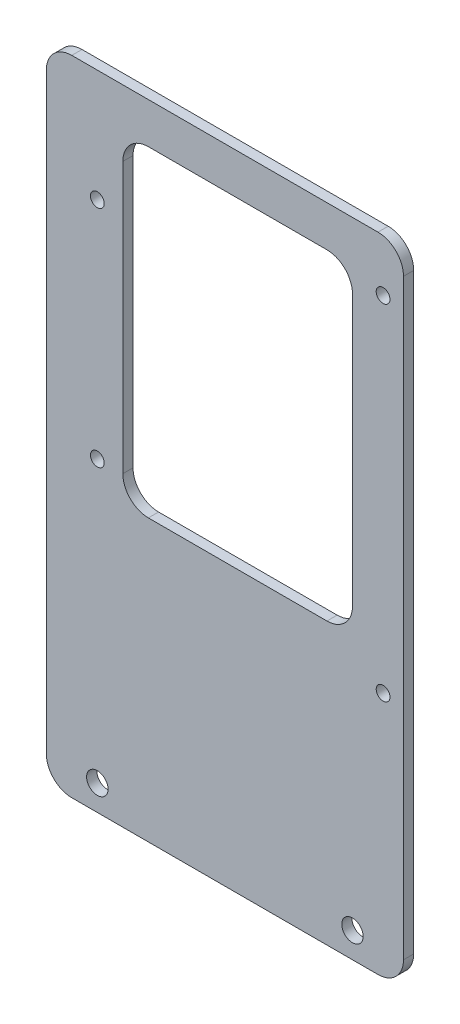
ISO-10303-21;
HEADER;
FILE_DESCRIPTION(('STEP AP214'),'2;1');
FILE_NAME('part.step','',(''),(''),'','','');
FILE_SCHEMA(('AUTOMOTIVE_DESIGN { 1 0 10303 214 1 1 1 1 }'));
ENDSEC;
DATA;
#1=APPLICATION_CONTEXT('core data for automotive mechanical design processes');
#2=APPLICATION_PROTOCOL_DEFINITION('international standard','automotive_design',2000,#1);
#3=PRODUCT_CONTEXT('',#1,'mechanical');
#4=PRODUCT('Part','Part','',(#3));
#5=PRODUCT_RELATED_PRODUCT_CATEGORY('part','',(#4));
#6=PRODUCT_DEFINITION_FORMATION('','',#4);
#7=PRODUCT_DEFINITION_CONTEXT('part definition',#1,'design');
#8=PRODUCT_DEFINITION('design','',#6,#7);
#9=PRODUCT_DEFINITION_SHAPE('','',#8);
#10=(LENGTH_UNIT() NAMED_UNIT(*) SI_UNIT(.MILLI.,.METRE.));
#11=(NAMED_UNIT(*) PLANE_ANGLE_UNIT() SI_UNIT($,.RADIAN.));
#12=(NAMED_UNIT(*) SI_UNIT($,.STERADIAN.) SOLID_ANGLE_UNIT());
#13=UNCERTAINTY_MEASURE_WITH_UNIT(LENGTH_MEASURE(1.E-05),#10,'distance_accuracy_value','');
#14=(GEOMETRIC_REPRESENTATION_CONTEXT(3) GLOBAL_UNCERTAINTY_ASSIGNED_CONTEXT((#13)) GLOBAL_UNIT_ASSIGNED_CONTEXT((#10,
#11,#12)) REPRESENTATION_CONTEXT('',''));
#15=CARTESIAN_POINT('',(0.,0.,0.));
#16=DIRECTION('',(0.,0.,1.));
#17=DIRECTION('',(1.,0.,0.));
#18=AXIS2_PLACEMENT_3D('',#15,#16,#17);
#19=CARTESIAN_POINT('',(35.,-63.,2.));
#20=DIRECTION('',(-1.,0.,0.));
#21=DIRECTION('',(0.,0.,1.));
#22=AXIS2_PLACEMENT_3D('',#19,#20,#21);
#23=PLANE('',#22);
#24=DIRECTION('',(0.,1.,0.));
#25=VECTOR('',#24,1.);
#26=CARTESIAN_POINT('',(35.,-63.,2.));
#27=LINE('',#26,#25);
#28=CARTESIAN_POINT('',(35.,-58.,2.));
#29=VERTEX_POINT('',#28);
#30=CARTESIAN_POINT('',(35.,58.,2.));
#31=VERTEX_POINT('',#30);
#32=EDGE_CURVE('E167',#29,#31,#27,.T.);
#33=ORIENTED_EDGE('',*,*,#32,.F.);
#34=DIRECTION('',(0.,0.,-1.));
#35=VECTOR('',#34,1.);
#36=CARTESIAN_POINT('',(35.,-58.,2.));
#37=LINE('',#36,#35);
#38=CARTESIAN_POINT('',(35.,-58.,0.));
#39=VERTEX_POINT('',#38);
#40=EDGE_CURVE('E152',#29,#39,#37,.T.);
#41=ORIENTED_EDGE('',*,*,#40,.T.);
#42=DIRECTION('',(0.,1.,0.));
#43=VECTOR('',#42,1.);
#44=CARTESIAN_POINT('',(35.,-63.,0.));
#45=LINE('',#44,#43);
#46=CARTESIAN_POINT('',(35.,58.,0.));
#47=VERTEX_POINT('',#46);
#48=EDGE_CURVE('E164',#39,#47,#45,.T.);
#49=ORIENTED_EDGE('',*,*,#48,.T.);
#50=DIRECTION('',(0.,0.,-1.));
#51=VECTOR('',#50,1.);
#52=CARTESIAN_POINT('',(35.,58.,2.));
#53=LINE('',#52,#51);
#54=EDGE_CURVE('E169',#47,#31,#53,.F.);
#55=ORIENTED_EDGE('',*,*,#54,.T.);
#56=EDGE_LOOP('',(#33,#41,#49,#55));
#57=FACE_BOUND('',#56,.T.);
#58=ADVANCED_FACE('F34',(#57),#23,.F.);
#59=CARTESIAN_POINT('',(-35.,63.,2.));
#60=DIRECTION('',(0.,-1.,0.));
#61=DIRECTION('',(0.,0.,-1.));
#62=AXIS2_PLACEMENT_3D('',#59,#60,#61);
#63=PLANE('',#62);
#64=DIRECTION('',(-1.,0.,0.));
#65=VECTOR('',#64,1.);
#66=CARTESIAN_POINT('',(-35.,63.,2.));
#67=LINE('',#66,#65);
#68=CARTESIAN_POINT('',(30.,63.,2.));
#69=VERTEX_POINT('',#68);
#70=CARTESIAN_POINT('',(-30.,63.,2.));
#71=VERTEX_POINT('',#70);
#72=EDGE_CURVE('E347',#69,#71,#67,.T.);
#73=ORIENTED_EDGE('',*,*,#72,.F.);
#74=DIRECTION('',(0.,0.,-1.));
#75=VECTOR('',#74,1.);
#76=CARTESIAN_POINT('',(30.,63.,2.));
#77=LINE('',#76,#75);
#78=CARTESIAN_POINT('',(30.,63.,0.));
#79=VERTEX_POINT('',#78);
#80=EDGE_CURVE('E213',#69,#79,#77,.T.);
#81=ORIENTED_EDGE('',*,*,#80,.T.);
#82=DIRECTION('',(-1.,0.,0.));
#83=VECTOR('',#82,1.);
#84=CARTESIAN_POINT('',(-35.,63.,0.));
#85=LINE('',#84,#83);
#86=CARTESIAN_POINT('',(-30.,63.,0.));
#87=VERTEX_POINT('',#86);
#88=EDGE_CURVE('E174',#79,#87,#85,.T.);
#89=ORIENTED_EDGE('',*,*,#88,.T.);
#90=DIRECTION('',(0.,0.,-1.));
#91=VECTOR('',#90,1.);
#92=CARTESIAN_POINT('',(-30.,63.,2.));
#93=LINE('',#92,#91);
#94=EDGE_CURVE('E211',#87,#71,#93,.F.);
#95=ORIENTED_EDGE('',*,*,#94,.T.);
#96=EDGE_LOOP('',(#73,#81,#89,#95));
#97=FACE_BOUND('',#96,.T.);
#98=ADVANCED_FACE('F306',(#97),#63,.F.);
#99=CARTESIAN_POINT('',(-35.,-63.,2.));
#100=DIRECTION('',(1.,0.,0.));
#101=DIRECTION('',(0.,0.,-1.));
#102=AXIS2_PLACEMENT_3D('',#99,#100,#101);
#103=PLANE('',#102);
#104=DIRECTION('',(0.,-1.,0.));
#105=VECTOR('',#104,1.);
#106=CARTESIAN_POINT('',(-35.,-63.,0.));
#107=LINE('',#106,#105);
#108=CARTESIAN_POINT('',(-35.,58.,0.));
#109=VERTEX_POINT('',#108);
#110=CARTESIAN_POINT('',(-35.,-58.,0.));
#111=VERTEX_POINT('',#110);
#112=EDGE_CURVE('E178',#109,#111,#107,.T.);
#113=ORIENTED_EDGE('',*,*,#112,.T.);
#114=DIRECTION('',(0.,0.,-1.));
#115=VECTOR('',#114,1.);
#116=CARTESIAN_POINT('',(-35.,-58.,2.));
#117=LINE('',#116,#115);
#118=CARTESIAN_POINT('',(-35.,-58.,2.));
#119=VERTEX_POINT('',#118);
#120=EDGE_CURVE('E209',#111,#119,#117,.F.);
#121=ORIENTED_EDGE('',*,*,#120,.T.);
#122=DIRECTION('',(0.,-1.,0.));
#123=VECTOR('',#122,1.);
#124=CARTESIAN_POINT('',(-35.,-63.,2.));
#125=LINE('',#124,#123);
#126=CARTESIAN_POINT('',(-35.,58.,2.));
#127=VERTEX_POINT('',#126);
#128=EDGE_CURVE('E344',#127,#119,#125,.T.);
#129=ORIENTED_EDGE('',*,*,#128,.F.);
#130=DIRECTION('',(0.,0.,-1.));
#131=VECTOR('',#130,1.);
#132=CARTESIAN_POINT('',(-35.,58.,2.));
#133=LINE('',#132,#131);
#134=EDGE_CURVE('E206',#127,#109,#133,.T.);
#135=ORIENTED_EDGE('',*,*,#134,.T.);
#136=EDGE_LOOP('',(#113,#121,#129,#135));
#137=FACE_BOUND('',#136,.T.);
#138=ADVANCED_FACE('F311',(#137),#103,.F.);
#139=CARTESIAN_POINT('',(-35.,-63.,2.));
#140=DIRECTION('',(0.,1.,0.));
#141=DIRECTION('',(0.,0.,1.));
#142=AXIS2_PLACEMENT_3D('',#139,#140,#141);
#143=PLANE('',#142);
#144=DIRECTION('',(1.,0.,0.));
#145=VECTOR('',#144,1.);
#146=CARTESIAN_POINT('',(-35.,-63.,0.));
#147=LINE('',#146,#145);
#148=CARTESIAN_POINT('',(-30.,-63.,0.));
#149=VERTEX_POINT('',#148);
#150=CARTESIAN_POINT('',(30.,-63.,0.));
#151=VERTEX_POINT('',#150);
#152=EDGE_CURVE('E189',#149,#151,#147,.T.);
#153=ORIENTED_EDGE('',*,*,#152,.T.);
#154=DIRECTION('',(0.,0.,-1.));
#155=VECTOR('',#154,1.);
#156=CARTESIAN_POINT('',(30.,-63.,2.));
#157=LINE('',#156,#155);
#158=CARTESIAN_POINT('',(30.,-63.,2.));
#159=VERTEX_POINT('',#158);
#160=EDGE_CURVE('E153',#151,#159,#157,.F.);
#161=ORIENTED_EDGE('',*,*,#160,.T.);
#162=DIRECTION('',(1.,0.,0.));
#163=VECTOR('',#162,1.);
#164=CARTESIAN_POINT('',(-35.,-63.,2.));
#165=LINE('',#164,#163);
#166=CARTESIAN_POINT('',(-30.,-63.,2.));
#167=VERTEX_POINT('',#166);
#168=EDGE_CURVE('E184',#167,#159,#165,.T.);
#169=ORIENTED_EDGE('',*,*,#168,.F.);
#170=DIRECTION('',(0.,0.,-1.));
#171=VECTOR('',#170,1.);
#172=CARTESIAN_POINT('',(-30.,-63.,2.));
#173=LINE('',#172,#171);
#174=EDGE_CURVE('E158',#167,#149,#173,.T.);
#175=ORIENTED_EDGE('',*,*,#174,.T.);
#176=EDGE_LOOP('',(#153,#161,#169,#175));
#177=FACE_BOUND('',#176,.T.);
#178=ADVANCED_FACE('F401',(#177),#143,.F.);
#179=CARTESIAN_POINT('',(0.,0.,2.));
#180=DIRECTION('',(0.,0.,-1.));
#181=DIRECTION('',(-1.,0.,0.));
#182=AXIS2_PLACEMENT_3D('',#179,#180,#181);
#183=PLANE('',#182);
#184=DIRECTION('',(-1.,0.,0.));
#185=VECTOR('',#184,1.);
#186=CARTESIAN_POINT('',(-20.,55.,2.));
#187=LINE('',#186,#185);
#188=CARTESIAN_POINT('',(20.,55.,2.));
#189=VERTEX_POINT('',#188);
#190=CARTESIAN_POINT('',(-15.,55.,2.));
#191=VERTEX_POINT('',#190);
#192=EDGE_CURVE('E270',#189,#191,#187,.T.);
#193=ORIENTED_EDGE('',*,*,#192,.F.);
#194=CARTESIAN_POINT('',(20.,50.,2.));
#195=DIRECTION('',(0.,0.,-1.));
#196=DIRECTION('',(-1.,0.,0.));
#197=AXIS2_PLACEMENT_3D('',#194,#195,#196);
#198=CIRCLE('',#197,5.);
#199=CARTESIAN_POINT('',(25.,50.,2.));
#200=VERTEX_POINT('',#199);
#201=EDGE_CURVE('E57',#189,#200,#198,.T.);
#202=ORIENTED_EDGE('',*,*,#201,.T.);
#203=DIRECTION('',(0.,1.,0.));
#204=VECTOR('',#203,1.);
#205=CARTESIAN_POINT('',(25.,-8.,2.));
#206=LINE('',#205,#204);
#207=CARTESIAN_POINT('',(25.,-3.,2.));
#208=VERTEX_POINT('',#207);
#209=EDGE_CURVE('E289',#208,#200,#206,.T.);
#210=ORIENTED_EDGE('',*,*,#209,.F.);
#211=CARTESIAN_POINT('',(20.,-3.,2.));
#212=DIRECTION('',(0.,0.,-1.));
#213=DIRECTION('',(-1.,0.,0.));
#214=AXIS2_PLACEMENT_3D('',#211,#212,#213);
#215=CIRCLE('',#214,5.);
#216=CARTESIAN_POINT('',(20.,-8.,2.));
#217=VERTEX_POINT('',#216);
#218=EDGE_CURVE('E247',#208,#217,#215,.T.);
#219=ORIENTED_EDGE('',*,*,#218,.T.);
#220=DIRECTION('',(1.,0.,0.));
#221=VECTOR('',#220,1.);
#222=CARTESIAN_POINT('',(-20.,-8.,2.));
#223=LINE('',#222,#221);
#224=CARTESIAN_POINT('',(-15.,-8.,2.));
#225=VERTEX_POINT('',#224);
#226=EDGE_CURVE('E262',#225,#217,#223,.T.);
#227=ORIENTED_EDGE('',*,*,#226,.F.);
#228=CARTESIAN_POINT('',(-15.,-3.,2.));
#229=DIRECTION('',(0.,0.,-1.));
#230=DIRECTION('',(-1.,0.,0.));
#231=AXIS2_PLACEMENT_3D('',#228,#229,#230);
#232=CIRCLE('',#231,5.);
#233=CARTESIAN_POINT('',(-20.,-3.,2.));
#234=VERTEX_POINT('',#233);
#235=EDGE_CURVE('E42',#225,#234,#232,.T.);
#236=ORIENTED_EDGE('',*,*,#235,.T.);
#237=DIRECTION('',(0.,-1.,0.));
#238=VECTOR('',#237,1.);
#239=CARTESIAN_POINT('',(-20.,-8.,2.));
#240=LINE('',#239,#238);
#241=CARTESIAN_POINT('',(-20.,50.,2.));
#242=VERTEX_POINT('',#241);
#243=EDGE_CURVE('E260',#242,#234,#240,.T.);
#244=ORIENTED_EDGE('',*,*,#243,.F.);
#245=CARTESIAN_POINT('',(-15.,50.,2.));
#246=DIRECTION('',(0.,0.,-1.));
#247=DIRECTION('',(-1.,0.,0.));
#248=AXIS2_PLACEMENT_3D('',#245,#246,#247);
#249=CIRCLE('',#248,5.);
#250=EDGE_CURVE('E49',#242,#191,#249,.T.);
#251=ORIENTED_EDGE('',*,*,#250,.T.);
#252=EDGE_LOOP('',(#193,#202,#210,#219,#227,#236,#244,#251));
#253=FACE_BOUND('',#252,.T.);
#254=CARTESIAN_POINT('',(31.,52.75,2.));
#255=DIRECTION('',(0.,0.,1.));
#256=DIRECTION('',(1.,0.,0.));
#257=AXIS2_PLACEMENT_3D('',#254,#255,#256);
#258=CIRCLE('',#257,1.35000000000001);
#259=CARTESIAN_POINT('',(32.35,52.75,2.));
#260=VERTEX_POINT('',#259);
#261=EDGE_CURVE('E357',#260,#260,#258,.T.);
#262=ORIENTED_EDGE('',*,*,#261,.F.);
#263=EDGE_LOOP('',(#262));
#264=FACE_BOUND('',#263,.T.);
#265=CARTESIAN_POINT('',(25.,-58.,2.));
#266=DIRECTION('',(0.,0.,1.));
#267=DIRECTION('',(-1.,0.,0.));
#268=AXIS2_PLACEMENT_3D('',#265,#266,#267);
#269=CIRCLE('',#268,2.1);
#270=CARTESIAN_POINT('',(22.9,-58.,2.));
#271=VERTEX_POINT('',#270);
#272=EDGE_CURVE('E371',#271,#271,#269,.T.);
#273=ORIENTED_EDGE('',*,*,#272,.F.);
#274=EDGE_LOOP('',(#273));
#275=FACE_BOUND('',#274,.T.);
#276=CARTESIAN_POINT('',(-25.,-3.,2.));
#277=DIRECTION('',(0.,0.,1.));
#278=DIRECTION('',(1.,0.,0.));
#279=AXIS2_PLACEMENT_3D('',#276,#277,#278);
#280=CIRCLE('',#279,1.35);
#281=CARTESIAN_POINT('',(-23.65,-3.,2.));
#282=VERTEX_POINT('',#281);
#283=EDGE_CURVE('E364',#282,#282,#280,.T.);
#284=ORIENTED_EDGE('',*,*,#283,.F.);
#285=EDGE_LOOP('',(#284));
#286=FACE_BOUND('',#285,.T.);
#287=CARTESIAN_POINT('',(-25.,41.,2.));
#288=DIRECTION('',(0.,0.,1.));
#289=DIRECTION('',(1.,0.,0.));
#290=AXIS2_PLACEMENT_3D('',#287,#288,#289);
#291=CIRCLE('',#290,1.35);
#292=CARTESIAN_POINT('',(-23.65,41.,2.));
#293=VERTEX_POINT('',#292);
#294=EDGE_CURVE('E381',#293,#293,#291,.T.);
#295=ORIENTED_EDGE('',*,*,#294,.F.);
#296=EDGE_LOOP('',(#295));
#297=FACE_BOUND('',#296,.T.);
#298=CARTESIAN_POINT('',(31.,-14.75,2.));
#299=DIRECTION('',(0.,0.,1.));
#300=DIRECTION('',(1.,0.,0.));
#301=AXIS2_PLACEMENT_3D('',#298,#299,#300);
#302=CIRCLE('',#301,1.35);
#303=CARTESIAN_POINT('',(32.35,-14.75,2.));
#304=VERTEX_POINT('',#303);
#305=EDGE_CURVE('E363',#304,#304,#302,.T.);
#306=ORIENTED_EDGE('',*,*,#305,.F.);
#307=EDGE_LOOP('',(#306));
#308=FACE_BOUND('',#307,.T.);
#309=CARTESIAN_POINT('',(-25.,-58.,2.));
#310=DIRECTION('',(0.,0.,1.));
#311=DIRECTION('',(1.,0.,0.));
#312=AXIS2_PLACEMENT_3D('',#309,#310,#311);
#313=CIRCLE('',#312,2.1);
#314=CARTESIAN_POINT('',(-22.9,-58.,2.));
#315=VERTEX_POINT('',#314);
#316=EDGE_CURVE('E181',#315,#315,#313,.T.);
#317=ORIENTED_EDGE('',*,*,#316,.F.);
#318=EDGE_LOOP('',(#317));
#319=FACE_BOUND('',#318,.T.);
#320=ORIENTED_EDGE('',*,*,#168,.T.);
#321=CARTESIAN_POINT('',(30.,-58.,2.));
#322=DIRECTION('',(0.,0.,-1.));
#323=DIRECTION('',(-1.,0.,0.));
#324=AXIS2_PLACEMENT_3D('',#321,#322,#323);
#325=CIRCLE('',#324,5.);
#326=EDGE_CURVE('E204',#159,#29,#325,.F.);
#327=ORIENTED_EDGE('',*,*,#326,.T.);
#328=ORIENTED_EDGE('',*,*,#32,.T.);
#329=CARTESIAN_POINT('',(30.,58.,2.));
#330=DIRECTION('',(0.,0.,-1.));
#331=DIRECTION('',(-1.,0.,0.));
#332=AXIS2_PLACEMENT_3D('',#329,#330,#331);
#333=CIRCLE('',#332,5.);
#334=EDGE_CURVE('E200',#31,#69,#333,.F.);
#335=ORIENTED_EDGE('',*,*,#334,.T.);
#336=ORIENTED_EDGE('',*,*,#72,.T.);
#337=CARTESIAN_POINT('',(-30.,58.,2.));
#338=DIRECTION('',(0.,0.,-1.));
#339=DIRECTION('',(-1.,0.,0.));
#340=AXIS2_PLACEMENT_3D('',#337,#338,#339);
#341=CIRCLE('',#340,5.);
#342=EDGE_CURVE('E198',#71,#127,#341,.F.);
#343=ORIENTED_EDGE('',*,*,#342,.T.);
#344=ORIENTED_EDGE('',*,*,#128,.T.);
#345=CARTESIAN_POINT('',(-30.,-58.,2.));
#346=DIRECTION('',(0.,0.,-1.));
#347=DIRECTION('',(-1.,0.,0.));
#348=AXIS2_PLACEMENT_3D('',#345,#346,#347);
#349=CIRCLE('',#348,5.);
#350=EDGE_CURVE('E202',#119,#167,#349,.F.);
#351=ORIENTED_EDGE('',*,*,#350,.T.);
#352=EDGE_LOOP('',(#320,#327,#328,#335,#336,#343,#344,#351));
#353=FACE_BOUND('',#352,.T.);
#354=ADVANCED_FACE('F258',(#253,#264,#275,#286,#297,#308,#319,#353),#183,.F.);
#355=CARTESIAN_POINT('',(0.,0.,0.));
#356=DIRECTION('',(0.,0.,-1.));
#357=DIRECTION('',(-1.,0.,0.));
#358=AXIS2_PLACEMENT_3D('',#355,#356,#357);
#359=PLANE('',#358);
#360=DIRECTION('',(0.,-1.,0.));
#361=VECTOR('',#360,1.);
#362=CARTESIAN_POINT('',(25.,0.,0.));
#363=LINE('',#362,#361);
#364=CARTESIAN_POINT('',(25.,50.,0.));
#365=VERTEX_POINT('',#364);
#366=CARTESIAN_POINT('',(25.,-3.,0.));
#367=VERTEX_POINT('',#366);
#368=EDGE_CURVE('E225',#365,#367,#363,.T.);
#369=ORIENTED_EDGE('',*,*,#368,.F.);
#370=CARTESIAN_POINT('',(20.,50.,0.));
#371=DIRECTION('',(0.,0.,-1.));
#372=DIRECTION('',(-1.,0.,0.));
#373=AXIS2_PLACEMENT_3D('',#370,#371,#372);
#374=CIRCLE('',#373,5.);
#375=CARTESIAN_POINT('',(20.,55.,0.));
#376=VERTEX_POINT('',#375);
#377=EDGE_CURVE('E255',#365,#376,#374,.F.);
#378=ORIENTED_EDGE('',*,*,#377,.T.);
#379=DIRECTION('',(1.,0.,0.));
#380=VECTOR('',#379,1.);
#381=CARTESIAN_POINT('',(0.,55.,0.));
#382=LINE('',#381,#380);
#383=CARTESIAN_POINT('',(-15.,55.,0.));
#384=VERTEX_POINT('',#383);
#385=EDGE_CURVE('E216',#384,#376,#382,.T.);
#386=ORIENTED_EDGE('',*,*,#385,.F.);
#387=CARTESIAN_POINT('',(-15.,50.,0.));
#388=DIRECTION('',(0.,0.,-1.));
#389=DIRECTION('',(-1.,0.,0.));
#390=AXIS2_PLACEMENT_3D('',#387,#388,#389);
#391=CIRCLE('',#390,5.);
#392=CARTESIAN_POINT('',(-20.,50.,0.));
#393=VERTEX_POINT('',#392);
#394=EDGE_CURVE('E252',#384,#393,#391,.F.);
#395=ORIENTED_EDGE('',*,*,#394,.T.);
#396=DIRECTION('',(0.,1.,0.));
#397=VECTOR('',#396,1.);
#398=CARTESIAN_POINT('',(-20.,0.,0.));
#399=LINE('',#398,#397);
#400=CARTESIAN_POINT('',(-20.,-3.,0.));
#401=VERTEX_POINT('',#400);
#402=EDGE_CURVE('E219',#401,#393,#399,.T.);
#403=ORIENTED_EDGE('',*,*,#402,.F.);
#404=CARTESIAN_POINT('',(-15.,-3.,0.));
#405=DIRECTION('',(0.,0.,-1.));
#406=DIRECTION('',(-1.,0.,0.));
#407=AXIS2_PLACEMENT_3D('',#404,#405,#406);
#408=CIRCLE('',#407,5.);
#409=CARTESIAN_POINT('',(-15.,-8.,0.));
#410=VERTEX_POINT('',#409);
#411=EDGE_CURVE('E11',#401,#410,#408,.F.);
#412=ORIENTED_EDGE('',*,*,#411,.T.);
#413=DIRECTION('',(-1.,0.,0.));
#414=VECTOR('',#413,1.);
#415=CARTESIAN_POINT('',(0.,-8.,0.));
#416=LINE('',#415,#414);
#417=CARTESIAN_POINT('',(20.,-8.,0.));
#418=VERTEX_POINT('',#417);
#419=EDGE_CURVE('E222',#418,#410,#416,.T.);
#420=ORIENTED_EDGE('',*,*,#419,.F.);
#421=CARTESIAN_POINT('',(20.,-3.,0.));
#422=DIRECTION('',(0.,0.,-1.));
#423=DIRECTION('',(-1.,0.,0.));
#424=AXIS2_PLACEMENT_3D('',#421,#422,#423);
#425=CIRCLE('',#424,5.);
#426=EDGE_CURVE('E249',#418,#367,#425,.F.);
#427=ORIENTED_EDGE('',*,*,#426,.T.);
#428=EDGE_LOOP('',(#369,#378,#386,#395,#403,#412,#420,#427));
#429=FACE_BOUND('',#428,.T.);
#430=CARTESIAN_POINT('',(31.,52.75,0.));
#431=DIRECTION('',(0.,0.,1.));
#432=DIRECTION('',(1.,0.,0.));
#433=AXIS2_PLACEMENT_3D('',#430,#431,#432);
#434=CIRCLE('',#433,1.35000000000001);
#435=CARTESIAN_POINT('',(32.35,52.75,0.));
#436=VERTEX_POINT('',#435);
#437=EDGE_CURVE('E360',#436,#436,#434,.T.);
#438=ORIENTED_EDGE('',*,*,#437,.T.);
#439=EDGE_LOOP('',(#438));
#440=FACE_BOUND('',#439,.T.);
#441=CARTESIAN_POINT('',(25.,-58.,0.));
#442=DIRECTION('',(0.,0.,1.));
#443=DIRECTION('',(-1.,0.,0.));
#444=AXIS2_PLACEMENT_3D('',#441,#442,#443);
#445=CIRCLE('',#444,2.1);
#446=CARTESIAN_POINT('',(22.9,-58.,0.));
#447=VERTEX_POINT('',#446);
#448=EDGE_CURVE('E355',#447,#447,#445,.T.);
#449=ORIENTED_EDGE('',*,*,#448,.T.);
#450=EDGE_LOOP('',(#449));
#451=FACE_BOUND('',#450,.T.);
#452=CARTESIAN_POINT('',(-25.,-3.,0.));
#453=DIRECTION('',(0.,0.,1.));
#454=DIRECTION('',(1.,0.,0.));
#455=AXIS2_PLACEMENT_3D('',#452,#453,#454);
#456=CIRCLE('',#455,1.35);
#457=CARTESIAN_POINT('',(-23.65,-3.,0.));
#458=VERTEX_POINT('',#457);
#459=EDGE_CURVE('E367',#458,#458,#456,.T.);
#460=ORIENTED_EDGE('',*,*,#459,.T.);
#461=EDGE_LOOP('',(#460));
#462=FACE_BOUND('',#461,.T.);
#463=CARTESIAN_POINT('',(-25.,41.,0.));
#464=DIRECTION('',(0.,0.,1.));
#465=DIRECTION('',(1.,0.,0.));
#466=AXIS2_PLACEMENT_3D('',#463,#464,#465);
#467=CIRCLE('',#466,1.35);
#468=CARTESIAN_POINT('',(-23.65,41.,0.));
#469=VERTEX_POINT('',#468);
#470=EDGE_CURVE('E368',#469,#469,#467,.T.);
#471=ORIENTED_EDGE('',*,*,#470,.T.);
#472=EDGE_LOOP('',(#471));
#473=FACE_BOUND('',#472,.T.);
#474=CARTESIAN_POINT('',(31.,-14.75,0.));
#475=DIRECTION('',(0.,0.,1.));
#476=DIRECTION('',(1.,0.,0.));
#477=AXIS2_PLACEMENT_3D('',#474,#475,#476);
#478=CIRCLE('',#477,1.35);
#479=CARTESIAN_POINT('',(32.35,-14.75,0.));
#480=VERTEX_POINT('',#479);
#481=EDGE_CURVE('E378',#480,#480,#478,.T.);
#482=ORIENTED_EDGE('',*,*,#481,.T.);
#483=EDGE_LOOP('',(#482));
#484=FACE_BOUND('',#483,.T.);
#485=CARTESIAN_POINT('',(-25.,-58.,0.));
#486=DIRECTION('',(0.,0.,1.));
#487=DIRECTION('',(1.,0.,0.));
#488=AXIS2_PLACEMENT_3D('',#485,#486,#487);
#489=CIRCLE('',#488,2.1);
#490=CARTESIAN_POINT('',(-22.9,-58.,0.));
#491=VERTEX_POINT('',#490);
#492=EDGE_CURVE('E175',#491,#491,#489,.T.);
#493=ORIENTED_EDGE('',*,*,#492,.T.);
#494=EDGE_LOOP('',(#493));
#495=FACE_BOUND('',#494,.T.);
#496=ORIENTED_EDGE('',*,*,#48,.F.);
#497=CARTESIAN_POINT('',(30.,-58.,0.));
#498=DIRECTION('',(0.,0.,-1.));
#499=DIRECTION('',(-1.,0.,0.));
#500=AXIS2_PLACEMENT_3D('',#497,#498,#499);
#501=CIRCLE('',#500,5.);
#502=EDGE_CURVE('E148',#39,#151,#501,.T.);
#503=ORIENTED_EDGE('',*,*,#502,.T.);
#504=ORIENTED_EDGE('',*,*,#152,.F.);
#505=CARTESIAN_POINT('',(-30.,-58.,0.));
#506=DIRECTION('',(0.,0.,-1.));
#507=DIRECTION('',(-1.,0.,0.));
#508=AXIS2_PLACEMENT_3D('',#505,#506,#507);
#509=CIRCLE('',#508,5.);
#510=EDGE_CURVE('E159',#149,#111,#509,.T.);
#511=ORIENTED_EDGE('',*,*,#510,.T.);
#512=ORIENTED_EDGE('',*,*,#112,.F.);
#513=CARTESIAN_POINT('',(-30.,58.,0.));
#514=DIRECTION('',(0.,0.,-1.));
#515=DIRECTION('',(-1.,0.,0.));
#516=AXIS2_PLACEMENT_3D('',#513,#514,#515);
#517=CIRCLE('',#516,5.);
#518=EDGE_CURVE('E168',#109,#87,#517,.T.);
#519=ORIENTED_EDGE('',*,*,#518,.T.);
#520=ORIENTED_EDGE('',*,*,#88,.F.);
#521=CARTESIAN_POINT('',(30.,58.,0.));
#522=DIRECTION('',(0.,0.,-1.));
#523=DIRECTION('',(-1.,0.,0.));
#524=AXIS2_PLACEMENT_3D('',#521,#522,#523);
#525=CIRCLE('',#524,5.);
#526=EDGE_CURVE('E173',#79,#47,#525,.T.);
#527=ORIENTED_EDGE('',*,*,#526,.T.);
#528=EDGE_LOOP('',(#496,#503,#504,#511,#512,#519,#520,#527));
#529=FACE_BOUND('',#528,.T.);
#530=ADVANCED_FACE('F171',(#429,#440,#451,#462,#473,#484,#495,#529),#359,.T.);
#531=CARTESIAN_POINT('',(30.,-58.,2.));
#532=DIRECTION('',(0.,0.,-1.));
#533=DIRECTION('',(-1.,0.,0.));
#534=AXIS2_PLACEMENT_3D('',#531,#532,#533);
#535=CYLINDRICAL_SURFACE('',#534,5.);
#536=ORIENTED_EDGE('',*,*,#326,.F.);
#537=ORIENTED_EDGE('',*,*,#160,.F.);
#538=ORIENTED_EDGE('',*,*,#502,.F.);
#539=ORIENTED_EDGE('',*,*,#40,.F.);
#540=EDGE_LOOP('',(#536,#537,#538,#539));
#541=FACE_BOUND('',#540,.T.);
#542=ADVANCED_FACE('F151',(#541),#535,.T.);
#543=CARTESIAN_POINT('',(-30.,-58.,2.));
#544=DIRECTION('',(0.,0.,-1.));
#545=DIRECTION('',(-1.,0.,0.));
#546=AXIS2_PLACEMENT_3D('',#543,#544,#545);
#547=CYLINDRICAL_SURFACE('',#546,5.);
#548=ORIENTED_EDGE('',*,*,#350,.F.);
#549=ORIENTED_EDGE('',*,*,#120,.F.);
#550=ORIENTED_EDGE('',*,*,#510,.F.);
#551=ORIENTED_EDGE('',*,*,#174,.F.);
#552=EDGE_LOOP('',(#548,#549,#550,#551));
#553=FACE_BOUND('',#552,.T.);
#554=ADVANCED_FACE('F318',(#553),#547,.T.);
#555=CARTESIAN_POINT('',(30.,58.,2.));
#556=DIRECTION('',(0.,0.,-1.));
#557=DIRECTION('',(-1.,0.,0.));
#558=AXIS2_PLACEMENT_3D('',#555,#556,#557);
#559=CYLINDRICAL_SURFACE('',#558,5.);
#560=ORIENTED_EDGE('',*,*,#334,.F.);
#561=ORIENTED_EDGE('',*,*,#54,.F.);
#562=ORIENTED_EDGE('',*,*,#526,.F.);
#563=ORIENTED_EDGE('',*,*,#80,.F.);
#564=EDGE_LOOP('',(#560,#561,#562,#563));
#565=FACE_BOUND('',#564,.T.);
#566=ADVANCED_FACE('F321',(#565),#559,.T.);
#567=CARTESIAN_POINT('',(-30.,58.,2.));
#568=DIRECTION('',(0.,0.,-1.));
#569=DIRECTION('',(-1.,0.,0.));
#570=AXIS2_PLACEMENT_3D('',#567,#568,#569);
#571=CYLINDRICAL_SURFACE('',#570,5.);
#572=ORIENTED_EDGE('',*,*,#342,.F.);
#573=ORIENTED_EDGE('',*,*,#94,.F.);
#574=ORIENTED_EDGE('',*,*,#518,.F.);
#575=ORIENTED_EDGE('',*,*,#134,.F.);
#576=EDGE_LOOP('',(#572,#573,#574,#575));
#577=FACE_BOUND('',#576,.T.);
#578=ADVANCED_FACE('F325',(#577),#571,.T.);
#579=CARTESIAN_POINT('',(-25.,-58.,0.));
#580=DIRECTION('',(0.,0.,1.));
#581=DIRECTION('',(1.,0.,0.));
#582=AXIS2_PLACEMENT_3D('',#579,#580,#581);
#583=CYLINDRICAL_SURFACE('',#582,2.1);
#584=ORIENTED_EDGE('',*,*,#492,.F.);
#585=EDGE_LOOP('',(#584));
#586=FACE_BOUND('',#585,.T.);
#587=ORIENTED_EDGE('',*,*,#316,.T.);
#588=EDGE_LOOP('',(#587));
#589=FACE_BOUND('',#588,.T.);
#590=ADVANCED_FACE('F328',(#586,#589),#583,.F.);
#591=CARTESIAN_POINT('',(31.,-14.75,0.));
#592=DIRECTION('',(0.,0.,1.));
#593=DIRECTION('',(1.,0.,0.));
#594=AXIS2_PLACEMENT_3D('',#591,#592,#593);
#595=CYLINDRICAL_SURFACE('',#594,1.35);
#596=ORIENTED_EDGE('',*,*,#481,.F.);
#597=EDGE_LOOP('',(#596));
#598=FACE_BOUND('',#597,.T.);
#599=ORIENTED_EDGE('',*,*,#305,.T.);
#600=EDGE_LOOP('',(#599));
#601=FACE_BOUND('',#600,.T.);
#602=ADVANCED_FACE('F333',(#598,#601),#595,.F.);
#603=CARTESIAN_POINT('',(-25.,41.,0.));
#604=DIRECTION('',(0.,0.,1.));
#605=DIRECTION('',(1.,0.,0.));
#606=AXIS2_PLACEMENT_3D('',#603,#604,#605);
#607=CYLINDRICAL_SURFACE('',#606,1.35);
#608=ORIENTED_EDGE('',*,*,#470,.F.);
#609=EDGE_LOOP('',(#608));
#610=FACE_BOUND('',#609,.T.);
#611=ORIENTED_EDGE('',*,*,#294,.T.);
#612=EDGE_LOOP('',(#611));
#613=FACE_BOUND('',#612,.T.);
#614=ADVANCED_FACE('F392',(#610,#613),#607,.F.);
#615=CARTESIAN_POINT('',(-25.,-3.,0.));
#616=DIRECTION('',(0.,0.,1.));
#617=DIRECTION('',(1.,0.,0.));
#618=AXIS2_PLACEMENT_3D('',#615,#616,#617);
#619=CYLINDRICAL_SURFACE('',#618,1.35);
#620=ORIENTED_EDGE('',*,*,#459,.F.);
#621=EDGE_LOOP('',(#620));
#622=FACE_BOUND('',#621,.T.);
#623=ORIENTED_EDGE('',*,*,#283,.T.);
#624=EDGE_LOOP('',(#623));
#625=FACE_BOUND('',#624,.T.);
#626=ADVANCED_FACE('F395',(#622,#625),#619,.F.);
#627=CARTESIAN_POINT('',(25.,-58.,0.));
#628=DIRECTION('',(0.,0.,1.));
#629=DIRECTION('',(1.,0.,0.));
#630=AXIS2_PLACEMENT_3D('',#627,#628,#629);
#631=CYLINDRICAL_SURFACE('',#630,2.1);
#632=ORIENTED_EDGE('',*,*,#448,.F.);
#633=EDGE_LOOP('',(#632));
#634=FACE_BOUND('',#633,.T.);
#635=ORIENTED_EDGE('',*,*,#272,.T.);
#636=EDGE_LOOP('',(#635));
#637=FACE_BOUND('',#636,.T.);
#638=ADVANCED_FACE('F416',(#634,#637),#631,.F.);
#639=CARTESIAN_POINT('',(31.,52.75,0.));
#640=DIRECTION('',(0.,0.,1.));
#641=DIRECTION('',(1.,0.,0.));
#642=AXIS2_PLACEMENT_3D('',#639,#640,#641);
#643=CYLINDRICAL_SURFACE('',#642,1.35000000000001);
#644=ORIENTED_EDGE('',*,*,#437,.F.);
#645=EDGE_LOOP('',(#644));
#646=FACE_BOUND('',#645,.T.);
#647=ORIENTED_EDGE('',*,*,#261,.T.);
#648=EDGE_LOOP('',(#647));
#649=FACE_BOUND('',#648,.T.);
#650=ADVANCED_FACE('F419',(#646,#649),#643,.F.);
#651=CARTESIAN_POINT('',(25.,-8.,-8.));
#652=DIRECTION('',(1.,0.,0.));
#653=DIRECTION('',(0.,0.,-1.));
#654=AXIS2_PLACEMENT_3D('',#651,#652,#653);
#655=PLANE('',#654);
#656=ORIENTED_EDGE('',*,*,#368,.T.);
#657=DIRECTION('',(0.,0.,1.));
#658=VECTOR('',#657,1.);
#659=CARTESIAN_POINT('',(25.,-3.,2.));
#660=LINE('',#659,#658);
#661=EDGE_CURVE('E230',#367,#208,#660,.T.);
#662=ORIENTED_EDGE('',*,*,#661,.T.);
#663=ORIENTED_EDGE('',*,*,#209,.T.);
#664=DIRECTION('',(0.,0.,1.));
#665=VECTOR('',#664,1.);
#666=CARTESIAN_POINT('',(25.,50.,0.));
#667=LINE('',#666,#665);
#668=EDGE_CURVE('E228',#200,#365,#667,.F.);
#669=ORIENTED_EDGE('',*,*,#668,.T.);
#670=EDGE_LOOP('',(#656,#662,#663,#669));
#671=FACE_BOUND('',#670,.T.);
#672=ADVANCED_FACE('F286',(#671),#655,.F.);
#673=CARTESIAN_POINT('',(-20.,-8.,-8.));
#674=DIRECTION('',(0.,-1.,0.));
#675=DIRECTION('',(0.,0.,-1.));
#676=AXIS2_PLACEMENT_3D('',#673,#674,#675);
#677=PLANE('',#676);
#678=ORIENTED_EDGE('',*,*,#226,.T.);
#679=DIRECTION('',(0.,0.,1.));
#680=VECTOR('',#679,1.);
#681=CARTESIAN_POINT('',(20.,-8.,0.));
#682=LINE('',#681,#680);
#683=EDGE_CURVE('E236',#217,#418,#682,.F.);
#684=ORIENTED_EDGE('',*,*,#683,.T.);
#685=ORIENTED_EDGE('',*,*,#419,.T.);
#686=DIRECTION('',(0.,0.,1.));
#687=VECTOR('',#686,1.);
#688=CARTESIAN_POINT('',(-15.,-8.,2.));
#689=LINE('',#688,#687);
#690=EDGE_CURVE('E233',#410,#225,#689,.T.);
#691=ORIENTED_EDGE('',*,*,#690,.T.);
#692=EDGE_LOOP('',(#678,#684,#685,#691));
#693=FACE_BOUND('',#692,.T.);
#694=ADVANCED_FACE('F279',(#693),#677,.F.);
#695=CARTESIAN_POINT('',(-20.,-8.,-8.));
#696=DIRECTION('',(-1.,0.,0.));
#697=DIRECTION('',(0.,0.,1.));
#698=AXIS2_PLACEMENT_3D('',#695,#696,#697);
#699=PLANE('',#698);
#700=ORIENTED_EDGE('',*,*,#402,.T.);
#701=DIRECTION('',(0.,0.,1.));
#702=VECTOR('',#701,1.);
#703=CARTESIAN_POINT('',(-20.,50.,2.));
#704=LINE('',#703,#702);
#705=EDGE_CURVE('E240',#393,#242,#704,.T.);
#706=ORIENTED_EDGE('',*,*,#705,.T.);
#707=ORIENTED_EDGE('',*,*,#243,.T.);
#708=DIRECTION('',(0.,0.,1.));
#709=VECTOR('',#708,1.);
#710=CARTESIAN_POINT('',(-20.,-3.,0.));
#711=LINE('',#710,#709);
#712=EDGE_CURVE('E238',#234,#401,#711,.F.);
#713=ORIENTED_EDGE('',*,*,#712,.T.);
#714=EDGE_LOOP('',(#700,#706,#707,#713));
#715=FACE_BOUND('',#714,.T.);
#716=ADVANCED_FACE('F267',(#715),#699,.F.);
#717=CARTESIAN_POINT('',(-20.,55.,-8.));
#718=DIRECTION('',(0.,1.,0.));
#719=DIRECTION('',(0.,0.,1.));
#720=AXIS2_PLACEMENT_3D('',#717,#718,#719);
#721=PLANE('',#720);
#722=ORIENTED_EDGE('',*,*,#192,.T.);
#723=DIRECTION('',(0.,0.,1.));
#724=VECTOR('',#723,1.);
#725=CARTESIAN_POINT('',(-15.,55.,0.));
#726=LINE('',#725,#724);
#727=EDGE_CURVE('E245',#191,#384,#726,.F.);
#728=ORIENTED_EDGE('',*,*,#727,.T.);
#729=ORIENTED_EDGE('',*,*,#385,.T.);
#730=DIRECTION('',(0.,0.,1.));
#731=VECTOR('',#730,1.);
#732=CARTESIAN_POINT('',(20.,55.,2.));
#733=LINE('',#732,#731);
#734=EDGE_CURVE('E243',#376,#189,#733,.T.);
#735=ORIENTED_EDGE('',*,*,#734,.T.);
#736=EDGE_LOOP('',(#722,#728,#729,#735));
#737=FACE_BOUND('',#736,.T.);
#738=ADVANCED_FACE('F294',(#737),#721,.F.);
#739=CARTESIAN_POINT('',(20.,-3.,-8.));
#740=DIRECTION('',(0.,0.,-1.));
#741=DIRECTION('',(-1.,0.,0.));
#742=AXIS2_PLACEMENT_3D('',#739,#740,#741);
#743=CYLINDRICAL_SURFACE('',#742,5.);
#744=ORIENTED_EDGE('',*,*,#426,.F.);
#745=ORIENTED_EDGE('',*,*,#683,.F.);
#746=ORIENTED_EDGE('',*,*,#218,.F.);
#747=ORIENTED_EDGE('',*,*,#661,.F.);
#748=EDGE_LOOP('',(#744,#745,#746,#747));
#749=FACE_BOUND('',#748,.T.);
#750=ADVANCED_FACE('F282',(#749),#743,.F.);
#751=CARTESIAN_POINT('',(-15.,50.,-8.));
#752=DIRECTION('',(0.,0.,-1.));
#753=DIRECTION('',(-1.,0.,0.));
#754=AXIS2_PLACEMENT_3D('',#751,#752,#753);
#755=CYLINDRICAL_SURFACE('',#754,5.);
#756=ORIENTED_EDGE('',*,*,#394,.F.);
#757=ORIENTED_EDGE('',*,*,#727,.F.);
#758=ORIENTED_EDGE('',*,*,#250,.F.);
#759=ORIENTED_EDGE('',*,*,#705,.F.);
#760=EDGE_LOOP('',(#756,#757,#758,#759));
#761=FACE_BOUND('',#760,.T.);
#762=ADVANCED_FACE('F297',(#761),#755,.F.);
#763=CARTESIAN_POINT('',(20.,50.,-8.));
#764=DIRECTION('',(0.,0.,-1.));
#765=DIRECTION('',(-1.,0.,0.));
#766=AXIS2_PLACEMENT_3D('',#763,#764,#765);
#767=CYLINDRICAL_SURFACE('',#766,5.);
#768=ORIENTED_EDGE('',*,*,#377,.F.);
#769=ORIENTED_EDGE('',*,*,#668,.F.);
#770=ORIENTED_EDGE('',*,*,#201,.F.);
#771=ORIENTED_EDGE('',*,*,#734,.F.);
#772=EDGE_LOOP('',(#768,#769,#770,#771));
#773=FACE_BOUND('',#772,.T.);
#774=ADVANCED_FACE('F290',(#773),#767,.F.);
#775=CARTESIAN_POINT('',(-15.,-3.,-8.));
#776=DIRECTION('',(0.,0.,-1.));
#777=DIRECTION('',(-1.,0.,0.));
#778=AXIS2_PLACEMENT_3D('',#775,#776,#777);
#779=CYLINDRICAL_SURFACE('',#778,5.);
#780=ORIENTED_EDGE('',*,*,#411,.F.);
#781=ORIENTED_EDGE('',*,*,#712,.F.);
#782=ORIENTED_EDGE('',*,*,#235,.F.);
#783=ORIENTED_EDGE('',*,*,#690,.F.);
#784=EDGE_LOOP('',(#780,#781,#782,#783));
#785=FACE_BOUND('',#784,.T.);
#786=ADVANCED_FACE('F36',(#785),#779,.F.);
#787=CLOSED_SHELL('',(#58,#98,#138,#178,#354,#530,#542,#554,#566,#578,#590,#602,#614,#626,#638,
#650,#672,#694,#716,#738,#750,#762,#774,#786));
#788=MANIFOLD_SOLID_BREP('B2',#787);
#789=ADVANCED_BREP_SHAPE_REPRESENTATION('',(#18,#788),#14);
#790=SHAPE_DEFINITION_REPRESENTATION(#9,#789);
ENDSEC;
END-ISO-10303-21;
